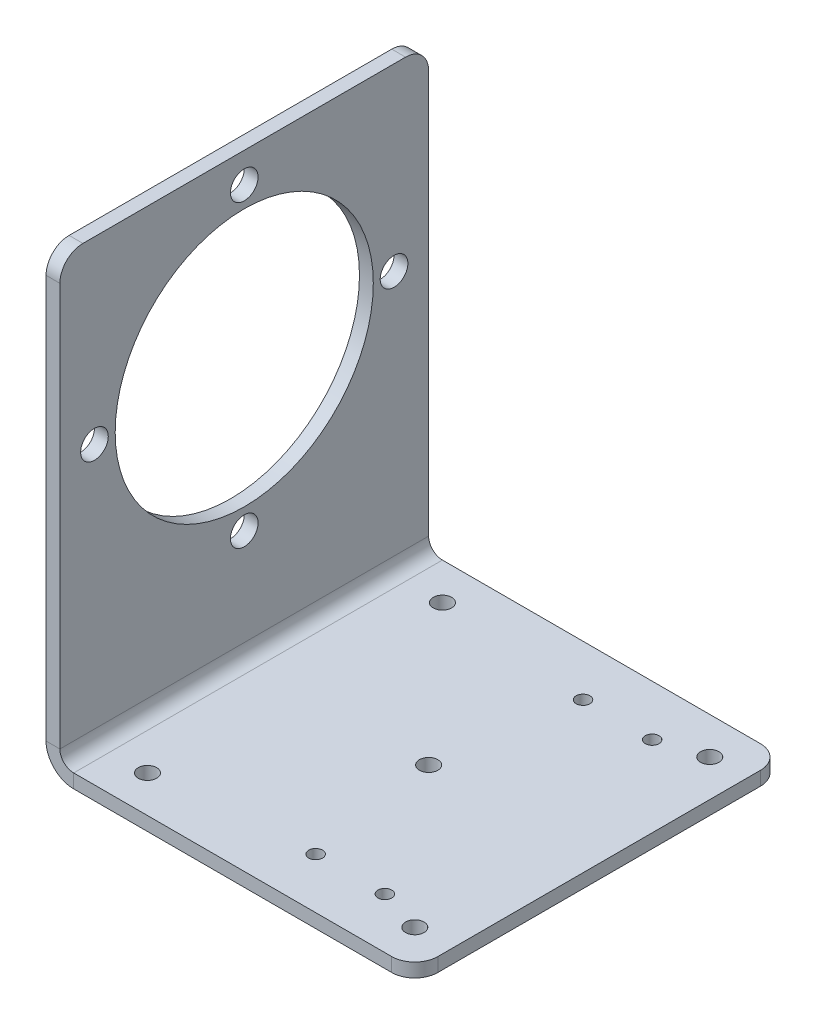
ISO-10303-21;
HEADER;
FILE_DESCRIPTION(('STEP AP214'),'2;1');
FILE_NAME('part.step','',(''),(''),'','','');
FILE_SCHEMA(('AUTOMOTIVE_DESIGN { 1 0 10303 214 1 1 1 1 }'));
ENDSEC;
DATA;
#1=APPLICATION_CONTEXT('core data for automotive mechanical design processes');
#2=APPLICATION_PROTOCOL_DEFINITION('international standard','automotive_design',2000,#1);
#3=PRODUCT_CONTEXT('',#1,'mechanical');
#4=PRODUCT('Part','Part','',(#3));
#5=PRODUCT_RELATED_PRODUCT_CATEGORY('part','',(#4));
#6=PRODUCT_DEFINITION_FORMATION('','',#4);
#7=PRODUCT_DEFINITION_CONTEXT('part definition',#1,'design');
#8=PRODUCT_DEFINITION('design','',#6,#7);
#9=PRODUCT_DEFINITION_SHAPE('','',#8);
#10=(LENGTH_UNIT() NAMED_UNIT(*) SI_UNIT(.MILLI.,.METRE.));
#11=(NAMED_UNIT(*) PLANE_ANGLE_UNIT() SI_UNIT($,.RADIAN.));
#12=(NAMED_UNIT(*) SI_UNIT($,.STERADIAN.) SOLID_ANGLE_UNIT());
#13=UNCERTAINTY_MEASURE_WITH_UNIT(LENGTH_MEASURE(1.E-05),#10,'distance_accuracy_value','');
#14=(GEOMETRIC_REPRESENTATION_CONTEXT(3) GLOBAL_UNCERTAINTY_ASSIGNED_CONTEXT((#13)) GLOBAL_UNIT_ASSIGNED_CONTEXT((#10,
#11,#12)) REPRESENTATION_CONTEXT('',''));
#15=CARTESIAN_POINT('',(0.,0.,0.));
#16=DIRECTION('',(0.,0.,1.));
#17=DIRECTION('',(1.,0.,0.));
#18=AXIS2_PLACEMENT_3D('',#15,#16,#17);
#19=CARTESIAN_POINT('',(0.,0.,0.));
#20=DIRECTION('',(-1.,0.,0.));
#21=DIRECTION('',(0.,0.,1.));
#22=AXIS2_PLACEMENT_3D('',#19,#20,#21);
#23=PLANE('',#22);
#24=CARTESIAN_POINT('',(0.,59.5000000000003,-72.5));
#25=DIRECTION('',(1.,0.,0.));
#26=DIRECTION('',(0.,0.,-1.));
#27=AXIS2_PLACEMENT_3D('',#24,#25,#26);
#28=CIRCLE('',#27,3.);
#29=CARTESIAN_POINT('',(0.,59.5000000000003,-75.5));
#30=VERTEX_POINT('',#29);
#31=EDGE_CURVE('E215',#30,#30,#28,.T.);
#32=ORIENTED_EDGE('',*,*,#31,.F.);
#33=EDGE_LOOP('',(#32));
#34=FACE_BOUND('',#33,.T.);
#35=CARTESIAN_POINT('',(0.,59.5,-40.));
#36=DIRECTION('',(1.,0.,0.));
#37=DIRECTION('',(0.,0.,-1.));
#38=AXIS2_PLACEMENT_3D('',#35,#36,#37);
#39=CIRCLE('',#38,28.);
#40=CARTESIAN_POINT('',(0.,59.5,-68.));
#41=VERTEX_POINT('',#40);
#42=EDGE_CURVE('E240',#41,#41,#39,.T.);
#43=ORIENTED_EDGE('',*,*,#42,.F.);
#44=EDGE_LOOP('',(#43));
#45=FACE_BOUND('',#44,.T.);
#46=CARTESIAN_POINT('',(0.,92.,-40.));
#47=DIRECTION('',(1.,0.,0.));
#48=DIRECTION('',(0.,0.,-1.));
#49=AXIS2_PLACEMENT_3D('',#46,#47,#48);
#50=CIRCLE('',#49,3.);
#51=CARTESIAN_POINT('',(0.,92.,-43.));
#52=VERTEX_POINT('',#51);
#53=EDGE_CURVE('E234',#52,#52,#50,.T.);
#54=ORIENTED_EDGE('',*,*,#53,.F.);
#55=EDGE_LOOP('',(#54));
#56=FACE_BOUND('',#55,.T.);
#57=CARTESIAN_POINT('',(0.,59.4999999999999,-7.50000000000001));
#58=DIRECTION('',(1.,0.,0.));
#59=DIRECTION('',(0.,0.,-1.));
#60=AXIS2_PLACEMENT_3D('',#57,#58,#59);
#61=CIRCLE('',#60,3.);
#62=CARTESIAN_POINT('',(0.,59.4999999999999,-10.5));
#63=VERTEX_POINT('',#62);
#64=EDGE_CURVE('E228',#63,#63,#61,.T.);
#65=ORIENTED_EDGE('',*,*,#64,.F.);
#66=EDGE_LOOP('',(#65));
#67=FACE_BOUND('',#66,.T.);
#68=CARTESIAN_POINT('',(0.,27.,-40.));
#69=DIRECTION('',(1.,0.,0.));
#70=DIRECTION('',(0.,0.,-1.));
#71=AXIS2_PLACEMENT_3D('',#68,#69,#70);
#72=CIRCLE('',#71,3.);
#73=CARTESIAN_POINT('',(0.,27.,-43.));
#74=VERTEX_POINT('',#73);
#75=EDGE_CURVE('E222',#74,#74,#72,.T.);
#76=ORIENTED_EDGE('',*,*,#75,.F.);
#77=EDGE_LOOP('',(#76));
#78=FACE_BOUND('',#77,.T.);
#79=DIRECTION('',(0.,1.,0.));
#80=VECTOR('',#79,1.);
#81=CARTESIAN_POINT('',(0.,0.,-80.));
#82=LINE('',#81,#80);
#83=CARTESIAN_POINT('',(0.,5.99999999999999,-80.));
#84=VERTEX_POINT('',#83);
#85=CARTESIAN_POINT('',(0.,93.5,-80.));
#86=VERTEX_POINT('',#85);
#87=EDGE_CURVE('E257',#84,#86,#82,.T.);
#88=ORIENTED_EDGE('',*,*,#87,.T.);
#89=CARTESIAN_POINT('',(0.,93.5,-75.));
#90=DIRECTION('',(-1.,0.,0.));
#91=DIRECTION('',(0.,0.,1.));
#92=AXIS2_PLACEMENT_3D('',#89,#90,#91);
#93=CIRCLE('',#92,5.);
#94=CARTESIAN_POINT('',(0.,98.5,-75.));
#95=VERTEX_POINT('',#94);
#96=EDGE_CURVE('E283',#86,#95,#93,.F.);
#97=ORIENTED_EDGE('',*,*,#96,.T.);
#98=DIRECTION('',(0.,0.,1.));
#99=VECTOR('',#98,1.);
#100=CARTESIAN_POINT('',(0.,98.5,0.));
#101=LINE('',#100,#99);
#102=CARTESIAN_POINT('',(0.,98.5,-5.));
#103=VERTEX_POINT('',#102);
#104=EDGE_CURVE('E250',#95,#103,#101,.T.);
#105=ORIENTED_EDGE('',*,*,#104,.T.);
#106=CARTESIAN_POINT('',(0.,93.5,-5.));
#107=DIRECTION('',(-1.,0.,0.));
#108=DIRECTION('',(0.,0.,1.));
#109=AXIS2_PLACEMENT_3D('',#106,#107,#108);
#110=CIRCLE('',#109,5.);
#111=CARTESIAN_POINT('',(0.,93.5,0.));
#112=VERTEX_POINT('',#111);
#113=EDGE_CURVE('E281',#103,#112,#110,.F.);
#114=ORIENTED_EDGE('',*,*,#113,.T.);
#115=DIRECTION('',(0.,-1.,0.));
#116=VECTOR('',#115,1.);
#117=CARTESIAN_POINT('',(0.,0.,0.));
#118=LINE('',#117,#116);
#119=CARTESIAN_POINT('',(0.,5.99999999999999,0.));
#120=VERTEX_POINT('',#119);
#121=EDGE_CURVE('E244',#112,#120,#118,.T.);
#122=ORIENTED_EDGE('',*,*,#121,.T.);
#123=DIRECTION('',(0.,0.,-1.));
#124=VECTOR('',#123,1.);
#125=CARTESIAN_POINT('',(0.,5.99999999999999,-80.));
#126=LINE('',#125,#124);
#127=EDGE_CURVE('E208',#84,#120,#126,.F.);
#128=ORIENTED_EDGE('',*,*,#127,.F.);
#129=EDGE_LOOP('',(#88,#97,#105,#114,#122,#128));
#130=FACE_BOUND('',#129,.T.);
#131=ADVANCED_FACE('F59',(#34,#45,#56,#67,#78,#130),#23,.F.);
#132=CARTESIAN_POINT('',(-3.,0.,0.));
#133=DIRECTION('',(-1.,0.,0.));
#134=DIRECTION('',(0.,0.,1.));
#135=AXIS2_PLACEMENT_3D('',#132,#133,#134);
#136=PLANE('',#135);
#137=CARTESIAN_POINT('',(-3.,59.5000000000003,-72.5));
#138=DIRECTION('',(1.,0.,0.));
#139=DIRECTION('',(0.,0.,-1.));
#140=AXIS2_PLACEMENT_3D('',#137,#138,#139);
#141=CIRCLE('',#140,3.);
#142=CARTESIAN_POINT('',(-3.,59.5000000000003,-75.5));
#143=VERTEX_POINT('',#142);
#144=EDGE_CURVE('E219',#143,#143,#141,.T.);
#145=ORIENTED_EDGE('',*,*,#144,.T.);
#146=EDGE_LOOP('',(#145));
#147=FACE_BOUND('',#146,.T.);
#148=CARTESIAN_POINT('',(-3.,59.5,-40.));
#149=DIRECTION('',(1.,0.,0.));
#150=DIRECTION('',(0.,0.,-1.));
#151=AXIS2_PLACEMENT_3D('',#148,#149,#150);
#152=CIRCLE('',#151,28.);
#153=CARTESIAN_POINT('',(-3.,59.5,-68.));
#154=VERTEX_POINT('',#153);
#155=EDGE_CURVE('E241',#154,#154,#152,.T.);
#156=ORIENTED_EDGE('',*,*,#155,.T.);
#157=EDGE_LOOP('',(#156));
#158=FACE_BOUND('',#157,.T.);
#159=CARTESIAN_POINT('',(-3.,92.,-40.));
#160=DIRECTION('',(1.,0.,0.));
#161=DIRECTION('',(0.,0.,-1.));
#162=AXIS2_PLACEMENT_3D('',#159,#160,#161);
#163=CIRCLE('',#162,3.);
#164=CARTESIAN_POINT('',(-3.,92.,-43.));
#165=VERTEX_POINT('',#164);
#166=EDGE_CURVE('E237',#165,#165,#163,.T.);
#167=ORIENTED_EDGE('',*,*,#166,.T.);
#168=EDGE_LOOP('',(#167));
#169=FACE_BOUND('',#168,.T.);
#170=CARTESIAN_POINT('',(-3.,59.4999999999999,-7.50000000000001));
#171=DIRECTION('',(1.,0.,0.));
#172=DIRECTION('',(0.,0.,-1.));
#173=AXIS2_PLACEMENT_3D('',#170,#171,#172);
#174=CIRCLE('',#173,3.);
#175=CARTESIAN_POINT('',(-3.,59.4999999999999,-10.5));
#176=VERTEX_POINT('',#175);
#177=EDGE_CURVE('E231',#176,#176,#174,.T.);
#178=ORIENTED_EDGE('',*,*,#177,.T.);
#179=EDGE_LOOP('',(#178));
#180=FACE_BOUND('',#179,.T.);
#181=CARTESIAN_POINT('',(-3.,27.,-40.));
#182=DIRECTION('',(1.,0.,0.));
#183=DIRECTION('',(0.,0.,-1.));
#184=AXIS2_PLACEMENT_3D('',#181,#182,#183);
#185=CIRCLE('',#184,3.);
#186=CARTESIAN_POINT('',(-3.,27.,-43.));
#187=VERTEX_POINT('',#186);
#188=EDGE_CURVE('E225',#187,#187,#185,.T.);
#189=ORIENTED_EDGE('',*,*,#188,.T.);
#190=EDGE_LOOP('',(#189));
#191=FACE_BOUND('',#190,.T.);
#192=DIRECTION('',(0.,0.,1.));
#193=VECTOR('',#192,1.);
#194=CARTESIAN_POINT('',(-3.,98.5,0.));
#195=LINE('',#194,#193);
#196=CARTESIAN_POINT('',(-3.,98.5,-75.));
#197=VERTEX_POINT('',#196);
#198=CARTESIAN_POINT('',(-3.,98.5,-5.));
#199=VERTEX_POINT('',#198);
#200=EDGE_CURVE('E253',#197,#199,#195,.T.);
#201=ORIENTED_EDGE('',*,*,#200,.F.);
#202=CARTESIAN_POINT('',(-3.,93.5,-75.));
#203=DIRECTION('',(-1.,0.,0.));
#204=DIRECTION('',(0.,0.,1.));
#205=AXIS2_PLACEMENT_3D('',#202,#203,#204);
#206=CIRCLE('',#205,5.);
#207=CARTESIAN_POINT('',(-3.,93.5,-80.));
#208=VERTEX_POINT('',#207);
#209=EDGE_CURVE('E67',#197,#208,#206,.T.);
#210=ORIENTED_EDGE('',*,*,#209,.T.);
#211=DIRECTION('',(0.,1.,0.));
#212=VECTOR('',#211,1.);
#213=CARTESIAN_POINT('',(-3.,0.,-80.));
#214=LINE('',#213,#212);
#215=CARTESIAN_POINT('',(-3.,5.99999999999999,-80.));
#216=VERTEX_POINT('',#215);
#217=EDGE_CURVE('E249',#216,#208,#214,.T.);
#218=ORIENTED_EDGE('',*,*,#217,.F.);
#219=DIRECTION('',(0.,0.,-1.));
#220=VECTOR('',#219,1.);
#221=CARTESIAN_POINT('',(-3.,5.99999999999999,-80.));
#222=LINE('',#221,#220);
#223=CARTESIAN_POINT('',(-3.,5.99999999999999,0.));
#224=VERTEX_POINT('',#223);
#225=EDGE_CURVE('E156',#216,#224,#222,.F.);
#226=ORIENTED_EDGE('',*,*,#225,.T.);
#227=DIRECTION('',(0.,-1.,0.));
#228=VECTOR('',#227,1.);
#229=CARTESIAN_POINT('',(-3.,0.,0.));
#230=LINE('',#229,#228);
#231=CARTESIAN_POINT('',(-3.,93.5,0.));
#232=VERTEX_POINT('',#231);
#233=EDGE_CURVE('E247',#232,#224,#230,.T.);
#234=ORIENTED_EDGE('',*,*,#233,.F.);
#235=CARTESIAN_POINT('',(-3.,93.5,-5.));
#236=DIRECTION('',(-1.,0.,0.));
#237=DIRECTION('',(0.,0.,1.));
#238=AXIS2_PLACEMENT_3D('',#235,#236,#237);
#239=CIRCLE('',#238,5.);
#240=EDGE_CURVE('E79',#232,#199,#239,.T.);
#241=ORIENTED_EDGE('',*,*,#240,.T.);
#242=EDGE_LOOP('',(#201,#210,#218,#226,#234,#241));
#243=FACE_BOUND('',#242,.T.);
#244=ADVANCED_FACE('F292',(#147,#158,#169,#180,#191,#243),#136,.T.);
#245=CARTESIAN_POINT('',(-3.,0.,-80.));
#246=DIRECTION('',(0.,0.,-1.));
#247=DIRECTION('',(-1.,0.,0.));
#248=AXIS2_PLACEMENT_3D('',#245,#246,#247);
#249=PLANE('',#248);
#250=ORIENTED_EDGE('',*,*,#217,.T.);
#251=DIRECTION('',(1.,0.,0.));
#252=VECTOR('',#251,1.);
#253=CARTESIAN_POINT('',(-3.,93.5,-80.));
#254=LINE('',#253,#252);
#255=EDGE_CURVE('E278',#208,#86,#254,.T.);
#256=ORIENTED_EDGE('',*,*,#255,.T.);
#257=ORIENTED_EDGE('',*,*,#87,.F.);
#258=DIRECTION('',(-1.,0.,0.));
#259=VECTOR('',#258,1.);
#260=CARTESIAN_POINT('',(0.,5.99999999999999,-80.));
#261=LINE('',#260,#259);
#262=EDGE_CURVE('E204',#84,#216,#261,.T.);
#263=ORIENTED_EDGE('',*,*,#262,.T.);
#264=EDGE_LOOP('',(#250,#256,#257,#263));
#265=FACE_BOUND('',#264,.T.);
#266=ADVANCED_FACE('F297',(#265),#249,.T.);
#267=CARTESIAN_POINT('',(-3.,0.,0.));
#268=DIRECTION('',(0.,0.,1.));
#269=DIRECTION('',(1.,0.,0.));
#270=AXIS2_PLACEMENT_3D('',#267,#268,#269);
#271=PLANE('',#270);
#272=ORIENTED_EDGE('',*,*,#121,.F.);
#273=DIRECTION('',(1.,0.,0.));
#274=VECTOR('',#273,1.);
#275=CARTESIAN_POINT('',(-3.,93.5,0.));
#276=LINE('',#275,#274);
#277=EDGE_CURVE('E13',#112,#232,#276,.F.);
#278=ORIENTED_EDGE('',*,*,#277,.T.);
#279=ORIENTED_EDGE('',*,*,#233,.T.);
#280=DIRECTION('',(-1.,0.,0.));
#281=VECTOR('',#280,1.);
#282=CARTESIAN_POINT('',(0.,5.99999999999999,0.));
#283=LINE('',#282,#281);
#284=EDGE_CURVE('E212',#120,#224,#283,.T.);
#285=ORIENTED_EDGE('',*,*,#284,.F.);
#286=EDGE_LOOP('',(#272,#278,#279,#285));
#287=FACE_BOUND('',#286,.T.);
#288=ADVANCED_FACE('F308',(#287),#271,.T.);
#289=CARTESIAN_POINT('',(-3.,98.5,0.));
#290=DIRECTION('',(0.,1.,0.));
#291=DIRECTION('',(0.,0.,1.));
#292=AXIS2_PLACEMENT_3D('',#289,#290,#291);
#293=PLANE('',#292);
#294=ORIENTED_EDGE('',*,*,#104,.F.);
#295=DIRECTION('',(1.,0.,0.));
#296=VECTOR('',#295,1.);
#297=CARTESIAN_POINT('',(-3.,98.5,-75.));
#298=LINE('',#297,#296);
#299=EDGE_CURVE('E288',#95,#197,#298,.F.);
#300=ORIENTED_EDGE('',*,*,#299,.T.);
#301=ORIENTED_EDGE('',*,*,#200,.T.);
#302=DIRECTION('',(1.,0.,0.));
#303=VECTOR('',#302,1.);
#304=CARTESIAN_POINT('',(-3.,98.5,-5.));
#305=LINE('',#304,#303);
#306=EDGE_CURVE('E285',#199,#103,#305,.T.);
#307=ORIENTED_EDGE('',*,*,#306,.T.);
#308=EDGE_LOOP('',(#294,#300,#301,#307));
#309=FACE_BOUND('',#308,.T.);
#310=ADVANCED_FACE('F304',(#309),#293,.T.);
#311=CARTESIAN_POINT('',(-3.,59.5,-40.));
#312=DIRECTION('',(1.,0.,0.));
#313=DIRECTION('',(0.,0.,-1.));
#314=AXIS2_PLACEMENT_3D('',#311,#312,#313);
#315=CYLINDRICAL_SURFACE('',#314,28.);
#316=ORIENTED_EDGE('',*,*,#155,.F.);
#317=EDGE_LOOP('',(#316));
#318=FACE_BOUND('',#317,.T.);
#319=ORIENTED_EDGE('',*,*,#42,.T.);
#320=EDGE_LOOP('',(#319));
#321=FACE_BOUND('',#320,.T.);
#322=ADVANCED_FACE('F437',(#318,#321),#315,.F.);
#323=CARTESIAN_POINT('',(0.,92.,-40.));
#324=DIRECTION('',(1.,0.,0.));
#325=DIRECTION('',(0.,0.,-1.));
#326=AXIS2_PLACEMENT_3D('',#323,#324,#325);
#327=CYLINDRICAL_SURFACE('',#326,3.);
#328=ORIENTED_EDGE('',*,*,#166,.F.);
#329=EDGE_LOOP('',(#328));
#330=FACE_BOUND('',#329,.T.);
#331=ORIENTED_EDGE('',*,*,#53,.T.);
#332=EDGE_LOOP('',(#331));
#333=FACE_BOUND('',#332,.T.);
#334=ADVANCED_FACE('F673',(#330,#333),#327,.F.);
#335=CARTESIAN_POINT('',(0.,59.4999999999999,-7.50000000000001));
#336=DIRECTION('',(1.,0.,0.));
#337=DIRECTION('',(0.,0.,-1.));
#338=AXIS2_PLACEMENT_3D('',#335,#336,#337);
#339=CYLINDRICAL_SURFACE('',#338,3.);
#340=ORIENTED_EDGE('',*,*,#177,.F.);
#341=EDGE_LOOP('',(#340));
#342=FACE_BOUND('',#341,.T.);
#343=ORIENTED_EDGE('',*,*,#64,.T.);
#344=EDGE_LOOP('',(#343));
#345=FACE_BOUND('',#344,.T.);
#346=ADVANCED_FACE('F716',(#342,#345),#339,.F.);
#347=CARTESIAN_POINT('',(0.,27.,-40.));
#348=DIRECTION('',(1.,0.,0.));
#349=DIRECTION('',(0.,0.,-1.));
#350=AXIS2_PLACEMENT_3D('',#347,#348,#349);
#351=CYLINDRICAL_SURFACE('',#350,3.);
#352=ORIENTED_EDGE('',*,*,#188,.F.);
#353=EDGE_LOOP('',(#352));
#354=FACE_BOUND('',#353,.T.);
#355=ORIENTED_EDGE('',*,*,#75,.T.);
#356=EDGE_LOOP('',(#355));
#357=FACE_BOUND('',#356,.T.);
#358=ADVANCED_FACE('F709',(#354,#357),#351,.F.);
#359=CARTESIAN_POINT('',(0.,59.5000000000003,-72.5));
#360=DIRECTION('',(1.,0.,0.));
#361=DIRECTION('',(0.,0.,-1.));
#362=AXIS2_PLACEMENT_3D('',#359,#360,#361);
#363=CYLINDRICAL_SURFACE('',#362,3.);
#364=ORIENTED_EDGE('',*,*,#144,.F.);
#365=EDGE_LOOP('',(#364));
#366=FACE_BOUND('',#365,.T.);
#367=ORIENTED_EDGE('',*,*,#31,.T.);
#368=EDGE_LOOP('',(#367));
#369=FACE_BOUND('',#368,.T.);
#370=ADVANCED_FACE('F644',(#366,#369),#363,.F.);
#371=CARTESIAN_POINT('',(3.,5.99999999999999,0.));
#372=DIRECTION('',(0.,0.,1.));
#373=DIRECTION('',(1.,0.,0.));
#374=AXIS2_PLACEMENT_3D('',#371,#372,#373);
#375=PLANE('',#374);
#376=DIRECTION('',(0.,1.,0.));
#377=VECTOR('',#376,1.);
#378=CARTESIAN_POINT('',(2.99999999999998,0.,0.));
#379=LINE('',#378,#377);
#380=CARTESIAN_POINT('',(2.99999999999999,2.99999999999999,0.));
#381=VERTEX_POINT('',#380);
#382=CARTESIAN_POINT('',(2.99999999999998,0.,0.));
#383=VERTEX_POINT('',#382);
#384=EDGE_CURVE('E198',#381,#383,#379,.F.);
#385=ORIENTED_EDGE('',*,*,#384,.F.);
#386=CARTESIAN_POINT('',(3.,5.99999999999999,0.));
#387=DIRECTION('',(0.,0.,-1.));
#388=DIRECTION('',(-1.,0.,0.));
#389=AXIS2_PLACEMENT_3D('',#386,#387,#388);
#390=CIRCLE('',#389,3.);
#391=EDGE_CURVE('E159',#120,#381,#390,.F.);
#392=ORIENTED_EDGE('',*,*,#391,.F.);
#393=ORIENTED_EDGE('',*,*,#284,.T.);
#394=CARTESIAN_POINT('',(3.,5.99999999999999,0.));
#395=DIRECTION('',(0.,0.,-1.));
#396=DIRECTION('',(-1.,0.,0.));
#397=AXIS2_PLACEMENT_3D('',#394,#395,#396);
#398=CIRCLE('',#397,6.);
#399=EDGE_CURVE('E203',#224,#383,#398,.F.);
#400=ORIENTED_EDGE('',*,*,#399,.T.);
#401=EDGE_LOOP('',(#385,#392,#393,#400));
#402=FACE_BOUND('',#401,.T.);
#403=ADVANCED_FACE('F312',(#402),#375,.T.);
#404=CARTESIAN_POINT('',(3.,5.99999999999999,-80.));
#405=DIRECTION('',(0.,0.,1.));
#406=DIRECTION('',(1.,0.,0.));
#407=AXIS2_PLACEMENT_3D('',#404,#405,#406);
#408=PLANE('',#407);
#409=CARTESIAN_POINT('',(3.,5.99999999999999,-80.));
#410=DIRECTION('',(0.,0.,-1.));
#411=DIRECTION('',(-1.,0.,0.));
#412=AXIS2_PLACEMENT_3D('',#409,#410,#411);
#413=CIRCLE('',#412,3.);
#414=CARTESIAN_POINT('',(2.99999999999999,2.99999999999999,-80.));
#415=VERTEX_POINT('',#414);
#416=EDGE_CURVE('E166',#415,#84,#413,.T.);
#417=ORIENTED_EDGE('',*,*,#416,.F.);
#418=DIRECTION('',(0.,1.,0.));
#419=VECTOR('',#418,1.);
#420=CARTESIAN_POINT('',(2.99999999999999,2.99999999999999,-80.));
#421=LINE('',#420,#419);
#422=CARTESIAN_POINT('',(2.99999999999998,0.,-80.));
#423=VERTEX_POINT('',#422);
#424=EDGE_CURVE('E163',#415,#423,#421,.F.);
#425=ORIENTED_EDGE('',*,*,#424,.T.);
#426=CARTESIAN_POINT('',(3.,5.99999999999999,-80.));
#427=DIRECTION('',(0.,0.,-1.));
#428=DIRECTION('',(-1.,0.,0.));
#429=AXIS2_PLACEMENT_3D('',#426,#427,#428);
#430=CIRCLE('',#429,6.);
#431=EDGE_CURVE('E148',#423,#216,#430,.T.);
#432=ORIENTED_EDGE('',*,*,#431,.T.);
#433=ORIENTED_EDGE('',*,*,#262,.F.);
#434=EDGE_LOOP('',(#417,#425,#432,#433));
#435=FACE_BOUND('',#434,.T.);
#436=ADVANCED_FACE('F164',(#435),#408,.F.);
#437=CARTESIAN_POINT('',(3.,5.99999999999999,-80.));
#438=DIRECTION('',(0.,0.,-1.));
#439=DIRECTION('',(0.,-1.,0.));
#440=AXIS2_PLACEMENT_3D('',#437,#438,#439);
#441=CYLINDRICAL_SURFACE('',#440,6.);
#442=ORIENTED_EDGE('',*,*,#225,.F.);
#443=ORIENTED_EDGE('',*,*,#431,.F.);
#444=DIRECTION('',(0.,0.,-1.));
#445=VECTOR('',#444,1.);
#446=CARTESIAN_POINT('',(2.99999999999998,0.,0.));
#447=LINE('',#446,#445);
#448=EDGE_CURVE('E153',#423,#383,#447,.F.);
#449=ORIENTED_EDGE('',*,*,#448,.T.);
#450=ORIENTED_EDGE('',*,*,#399,.F.);
#451=EDGE_LOOP('',(#442,#443,#449,#450));
#452=FACE_BOUND('',#451,.T.);
#453=ADVANCED_FACE('F150',(#452),#441,.T.);
#454=CARTESIAN_POINT('',(3.,5.99999999999999,-80.));
#455=DIRECTION('',(0.,0.,-1.));
#456=DIRECTION('',(0.,-1.,0.));
#457=AXIS2_PLACEMENT_3D('',#454,#455,#456);
#458=CYLINDRICAL_SURFACE('',#457,3.);
#459=ORIENTED_EDGE('',*,*,#127,.T.);
#460=ORIENTED_EDGE('',*,*,#391,.T.);
#461=DIRECTION('',(0.,0.,-1.));
#462=VECTOR('',#461,1.);
#463=CARTESIAN_POINT('',(2.99999999999999,2.99999999999999,0.));
#464=LINE('',#463,#462);
#465=EDGE_CURVE('E171',#381,#415,#464,.T.);
#466=ORIENTED_EDGE('',*,*,#465,.T.);
#467=ORIENTED_EDGE('',*,*,#416,.T.);
#468=EDGE_LOOP('',(#459,#460,#466,#467));
#469=FACE_BOUND('',#468,.T.);
#470=ADVANCED_FACE('F315',(#469),#458,.F.);
#471=CARTESIAN_POINT('',(77.,-2.68882138776405E-13,-80.));
#472=DIRECTION('',(0.,0.,1.));
#473=DIRECTION('',(1.,0.,0.));
#474=AXIS2_PLACEMENT_3D('',#471,#472,#473);
#475=PLANE('',#474);
#476=DIRECTION('',(-1.,0.,0.));
#477=VECTOR('',#476,1.);
#478=CARTESIAN_POINT('',(77.,2.99999999999973,-80.));
#479=LINE('',#478,#477);
#480=CARTESIAN_POINT('',(72.,2.99999999999975,-80.));
#481=VERTEX_POINT('',#480);
#482=EDGE_CURVE('E181',#415,#481,#479,.F.);
#483=ORIENTED_EDGE('',*,*,#482,.T.);
#484=DIRECTION('',(0.,1.,0.));
#485=VECTOR('',#484,1.);
#486=CARTESIAN_POINT('',(72.,-2.51424732082189E-13,-80.));
#487=LINE('',#486,#485);
#488=CARTESIAN_POINT('',(72.,-2.51386656396706E-13,-80.));
#489=VERTEX_POINT('',#488);
#490=EDGE_CURVE('E185',#481,#489,#487,.F.);
#491=ORIENTED_EDGE('',*,*,#490,.T.);
#492=DIRECTION('',(1.,0.,0.));
#493=VECTOR('',#492,1.);
#494=CARTESIAN_POINT('',(0.,0.,-80.));
#495=LINE('',#494,#493);
#496=EDGE_CURVE('E177',#423,#489,#495,.T.);
#497=ORIENTED_EDGE('',*,*,#496,.F.);
#498=ORIENTED_EDGE('',*,*,#424,.F.);
#499=EDGE_LOOP('',(#483,#491,#497,#498));
#500=FACE_BOUND('',#499,.T.);
#501=ADVANCED_FACE('F183',(#500),#475,.F.);
#502=CARTESIAN_POINT('',(0.,0.,0.));
#503=DIRECTION('',(0.,0.,-1.));
#504=DIRECTION('',(-1.,0.,0.));
#505=AXIS2_PLACEMENT_3D('',#502,#503,#504);
#506=PLANE('',#505);
#507=DIRECTION('',(-1.,0.,0.));
#508=VECTOR('',#507,1.);
#509=CARTESIAN_POINT('',(0.,0.,0.));
#510=LINE('',#509,#508);
#511=CARTESIAN_POINT('',(72.,-2.51386656396706E-13,0.));
#512=VERTEX_POINT('',#511);
#513=EDGE_CURVE('E180',#512,#383,#510,.T.);
#514=ORIENTED_EDGE('',*,*,#513,.F.);
#515=DIRECTION('',(0.,1.,0.));
#516=VECTOR('',#515,1.);
#517=CARTESIAN_POINT('',(72.,-2.51386656396706E-13,0.));
#518=LINE('',#517,#516);
#519=CARTESIAN_POINT('',(72.,2.99999999999975,0.));
#520=VERTEX_POINT('',#519);
#521=EDGE_CURVE('E255',#512,#520,#518,.T.);
#522=ORIENTED_EDGE('',*,*,#521,.T.);
#523=DIRECTION('',(1.,0.,0.));
#524=VECTOR('',#523,1.);
#525=CARTESIAN_POINT('',(0.,3.,0.));
#526=LINE('',#525,#524);
#527=EDGE_CURVE('E187',#520,#381,#526,.F.);
#528=ORIENTED_EDGE('',*,*,#527,.T.);
#529=ORIENTED_EDGE('',*,*,#384,.T.);
#530=EDGE_LOOP('',(#514,#522,#528,#529));
#531=FACE_BOUND('',#530,.T.);
#532=ADVANCED_FACE('F332',(#531),#506,.F.);
#533=CARTESIAN_POINT('',(0.,0.,0.));
#534=DIRECTION('',(0.,1.,0.));
#535=DIRECTION('',(-1.,0.,0.));
#536=AXIS2_PLACEMENT_3D('',#533,#534,#535);
#537=PLANE('',#536);
#538=CARTESIAN_POINT('',(44.5,-6.86516815617821E-13,-69.));
#539=DIRECTION('',(0.,1.,0.));
#540=DIRECTION('',(0.,0.,1.));
#541=AXIS2_PLACEMENT_3D('',#538,#539,#540);
#542=CIRCLE('',#541,1.5);
#543=CARTESIAN_POINT('',(44.5,-6.86516815617821E-13,-67.5));
#544=VERTEX_POINT('',#543);
#545=EDGE_CURVE('E381',#544,#544,#542,.T.);
#546=ORIENTED_EDGE('',*,*,#545,.T.);
#547=EDGE_LOOP('',(#546));
#548=FACE_BOUND('',#547,.T.);
#549=CARTESIAN_POINT('',(59.5,-7.3899220076612E-13,-69.));
#550=DIRECTION('',(0.,1.,0.));
#551=DIRECTION('',(0.,0.,1.));
#552=AXIS2_PLACEMENT_3D('',#549,#550,#551);
#553=CIRCLE('',#552,1.5);
#554=CARTESIAN_POINT('',(59.5,-7.3899220076612E-13,-67.5));
#555=VERTEX_POINT('',#554);
#556=EDGE_CURVE('E375',#555,#555,#553,.T.);
#557=ORIENTED_EDGE('',*,*,#556,.T.);
#558=EDGE_LOOP('',(#557));
#559=FACE_BOUND('',#558,.T.);
#560=CARTESIAN_POINT('',(44.5,-6.86516815617821E-13,-11.));
#561=DIRECTION('',(0.,1.,0.));
#562=DIRECTION('',(0.,0.,1.));
#563=AXIS2_PLACEMENT_3D('',#560,#561,#562);
#564=CIRCLE('',#563,1.5);
#565=CARTESIAN_POINT('',(44.5,-6.86516815617821E-13,-9.5));
#566=VERTEX_POINT('',#565);
#567=EDGE_CURVE('E369',#566,#566,#564,.T.);
#568=ORIENTED_EDGE('',*,*,#567,.T.);
#569=EDGE_LOOP('',(#568));
#570=FACE_BOUND('',#569,.T.);
#571=CARTESIAN_POINT('',(59.5,-7.3899220076612E-13,-11.));
#572=DIRECTION('',(0.,1.,0.));
#573=DIRECTION('',(0.,0.,1.));
#574=AXIS2_PLACEMENT_3D('',#571,#572,#573);
#575=CIRCLE('',#574,1.5);
#576=CARTESIAN_POINT('',(59.5,-7.3899220076612E-13,-9.49999999999999));
#577=VERTEX_POINT('',#576);
#578=EDGE_CURVE('E363',#577,#577,#575,.T.);
#579=ORIENTED_EDGE('',*,*,#578,.T.);
#580=EDGE_LOOP('',(#579));
#581=FACE_BOUND('',#580,.T.);
#582=CARTESIAN_POINT('',(11.,-3.18755438710738E-13,-7.99999999999999));
#583=DIRECTION('',(0.,1.,0.));
#584=DIRECTION('',(0.,0.,1.));
#585=AXIS2_PLACEMENT_3D('',#582,#583,#584);
#586=CIRCLE('',#585,1.99999999999999);
#587=CARTESIAN_POINT('',(11.,-3.18755438710738E-13,-6.00000000000001));
#588=VERTEX_POINT('',#587);
#589=EDGE_CURVE('E357',#588,#588,#586,.T.);
#590=ORIENTED_EDGE('',*,*,#589,.T.);
#591=EDGE_LOOP('',(#590));
#592=FACE_BOUND('',#591,.T.);
#593=CARTESIAN_POINT('',(11.,-3.18755438710738E-13,-72.));
#594=DIRECTION('',(0.,1.,0.));
#595=DIRECTION('',(0.,0.,1.));
#596=AXIS2_PLACEMENT_3D('',#593,#594,#595);
#597=CIRCLE('',#596,1.99999999999999);
#598=CARTESIAN_POINT('',(11.,-3.18755438710738E-13,-70.));
#599=VERTEX_POINT('',#598);
#600=EDGE_CURVE('E351',#599,#599,#597,.T.);
#601=ORIENTED_EDGE('',*,*,#600,.T.);
#602=EDGE_LOOP('',(#601));
#603=FACE_BOUND('',#602,.T.);
#604=CARTESIAN_POINT('',(69.,-5.21284404531031E-13,-72.));
#605=DIRECTION('',(0.,1.,0.));
#606=DIRECTION('',(0.,0.,1.));
#607=AXIS2_PLACEMENT_3D('',#604,#605,#606);
#608=CIRCLE('',#607,1.99999999999999);
#609=CARTESIAN_POINT('',(69.,-5.21284404531031E-13,-70.));
#610=VERTEX_POINT('',#609);
#611=EDGE_CURVE('E345',#610,#610,#608,.T.);
#612=ORIENTED_EDGE('',*,*,#611,.T.);
#613=EDGE_LOOP('',(#612));
#614=FACE_BOUND('',#613,.T.);
#615=CARTESIAN_POINT('',(69.,-5.21284404531031E-13,-8.));
#616=DIRECTION('',(0.,1.,0.));
#617=DIRECTION('',(0.,0.,1.));
#618=AXIS2_PLACEMENT_3D('',#615,#616,#617);
#619=CIRCLE('',#618,1.99999999999999);
#620=CARTESIAN_POINT('',(69.,-5.21284404531031E-13,-6.00000000000001));
#621=VERTEX_POINT('',#620);
#622=EDGE_CURVE('E339',#621,#621,#619,.T.);
#623=ORIENTED_EDGE('',*,*,#622,.T.);
#624=EDGE_LOOP('',(#623));
#625=FACE_BOUND('',#624,.T.);
#626=CARTESIAN_POINT('',(40.,-4.19803081186387E-13,-40.));
#627=DIRECTION('',(0.,1.,0.));
#628=DIRECTION('',(0.,0.,1.));
#629=AXIS2_PLACEMENT_3D('',#626,#627,#628);
#630=CIRCLE('',#629,1.99999999999999);
#631=CARTESIAN_POINT('',(40.,-4.19803081186387E-13,-38.));
#632=VERTEX_POINT('',#631);
#633=EDGE_CURVE('E201',#632,#632,#630,.T.);
#634=ORIENTED_EDGE('',*,*,#633,.T.);
#635=EDGE_LOOP('',(#634));
#636=FACE_BOUND('',#635,.T.);
#637=DIRECTION('',(0.,0.,1.));
#638=VECTOR('',#637,1.);
#639=CARTESIAN_POINT('',(77.,-2.68844063090921E-13,0.));
#640=LINE('',#639,#638);
#641=CARTESIAN_POINT('',(77.,-2.68844063090921E-13,-75.));
#642=VERTEX_POINT('',#641);
#643=CARTESIAN_POINT('',(77.,-2.68844063090921E-13,-5.));
#644=VERTEX_POINT('',#643);
#645=EDGE_CURVE('E186',#642,#644,#640,.T.);
#646=ORIENTED_EDGE('',*,*,#645,.T.);
#647=CARTESIAN_POINT('',(72.,-2.51386656396706E-13,-5.));
#648=DIRECTION('',(0.,1.,0.));
#649=DIRECTION('',(-1.,0.,0.));
#650=AXIS2_PLACEMENT_3D('',#647,#648,#649);
#651=CIRCLE('',#650,5.);
#652=EDGE_CURVE('E275',#644,#512,#651,.F.);
#653=ORIENTED_EDGE('',*,*,#652,.T.);
#654=ORIENTED_EDGE('',*,*,#513,.T.);
#655=ORIENTED_EDGE('',*,*,#448,.F.);
#656=ORIENTED_EDGE('',*,*,#496,.T.);
#657=CARTESIAN_POINT('',(72.,-2.51386656396706E-13,-75.));
#658=DIRECTION('',(0.,1.,0.));
#659=DIRECTION('',(-1.,0.,0.));
#660=AXIS2_PLACEMENT_3D('',#657,#658,#659);
#661=CIRCLE('',#660,5.);
#662=EDGE_CURVE('E273',#489,#642,#661,.F.);
#663=ORIENTED_EDGE('',*,*,#662,.T.);
#664=EDGE_LOOP('',(#646,#653,#654,#655,#656,#663));
#665=FACE_BOUND('',#664,.T.);
#666=ADVANCED_FACE('F176',(#548,#559,#570,#581,#592,#603,#614,#625,#636,#665),#537,.F.);
#667=CARTESIAN_POINT('',(0.,3.,0.));
#668=DIRECTION('',(0.,1.,0.));
#669=DIRECTION('',(-1.,0.,0.));
#670=AXIS2_PLACEMENT_3D('',#667,#668,#669);
#671=PLANE('',#670);
#672=CARTESIAN_POINT('',(44.5,2.99999999999985,-69.));
#673=DIRECTION('',(0.,1.,0.));
#674=DIRECTION('',(0.,0.,1.));
#675=AXIS2_PLACEMENT_3D('',#672,#673,#674);
#676=CIRCLE('',#675,1.5);
#677=CARTESIAN_POINT('',(44.5,2.99999999999985,-67.5));
#678=VERTEX_POINT('',#677);
#679=EDGE_CURVE('E384',#678,#678,#676,.T.);
#680=ORIENTED_EDGE('',*,*,#679,.F.);
#681=EDGE_LOOP('',(#680));
#682=FACE_BOUND('',#681,.T.);
#683=CARTESIAN_POINT('',(59.5,2.99999999999979,-69.));
#684=DIRECTION('',(0.,1.,0.));
#685=DIRECTION('',(0.,0.,1.));
#686=AXIS2_PLACEMENT_3D('',#683,#684,#685);
#687=CIRCLE('',#686,1.5);
#688=CARTESIAN_POINT('',(59.5,2.99999999999979,-67.5));
#689=VERTEX_POINT('',#688);
#690=EDGE_CURVE('E378',#689,#689,#687,.T.);
#691=ORIENTED_EDGE('',*,*,#690,.F.);
#692=EDGE_LOOP('',(#691));
#693=FACE_BOUND('',#692,.T.);
#694=CARTESIAN_POINT('',(44.5,2.99999999999985,-11.));
#695=DIRECTION('',(0.,1.,0.));
#696=DIRECTION('',(0.,0.,1.));
#697=AXIS2_PLACEMENT_3D('',#694,#695,#696);
#698=CIRCLE('',#697,1.5);
#699=CARTESIAN_POINT('',(44.5,2.99999999999985,-9.5));
#700=VERTEX_POINT('',#699);
#701=EDGE_CURVE('E372',#700,#700,#698,.T.);
#702=ORIENTED_EDGE('',*,*,#701,.F.);
#703=EDGE_LOOP('',(#702));
#704=FACE_BOUND('',#703,.T.);
#705=CARTESIAN_POINT('',(59.5,2.99999999999979,-11.));
#706=DIRECTION('',(0.,1.,0.));
#707=DIRECTION('',(0.,0.,1.));
#708=AXIS2_PLACEMENT_3D('',#705,#706,#707);
#709=CIRCLE('',#708,1.5);
#710=CARTESIAN_POINT('',(59.5,2.99999999999979,-9.49999999999999));
#711=VERTEX_POINT('',#710);
#712=EDGE_CURVE('E366',#711,#711,#709,.T.);
#713=ORIENTED_EDGE('',*,*,#712,.F.);
#714=EDGE_LOOP('',(#713));
#715=FACE_BOUND('',#714,.T.);
#716=CARTESIAN_POINT('',(11.,2.99999999999996,-7.99999999999999));
#717=DIRECTION('',(0.,1.,0.));
#718=DIRECTION('',(0.,0.,1.));
#719=AXIS2_PLACEMENT_3D('',#716,#717,#718);
#720=CIRCLE('',#719,1.99999999999999);
#721=CARTESIAN_POINT('',(11.,2.99999999999996,-6.00000000000001));
#722=VERTEX_POINT('',#721);
#723=EDGE_CURVE('E360',#722,#722,#720,.T.);
#724=ORIENTED_EDGE('',*,*,#723,.F.);
#725=EDGE_LOOP('',(#724));
#726=FACE_BOUND('',#725,.T.);
#727=CARTESIAN_POINT('',(11.,2.99999999999996,-72.));
#728=DIRECTION('',(0.,1.,0.));
#729=DIRECTION('',(0.,0.,1.));
#730=AXIS2_PLACEMENT_3D('',#727,#728,#729);
#731=CIRCLE('',#730,1.99999999999999);
#732=CARTESIAN_POINT('',(11.,2.99999999999996,-70.));
#733=VERTEX_POINT('',#732);
#734=EDGE_CURVE('E354',#733,#733,#731,.T.);
#735=ORIENTED_EDGE('',*,*,#734,.F.);
#736=EDGE_LOOP('',(#735));
#737=FACE_BOUND('',#736,.T.);
#738=CARTESIAN_POINT('',(69.,2.99999999999976,-72.));
#739=DIRECTION('',(0.,1.,0.));
#740=DIRECTION('',(0.,0.,1.));
#741=AXIS2_PLACEMENT_3D('',#738,#739,#740);
#742=CIRCLE('',#741,1.99999999999999);
#743=CARTESIAN_POINT('',(69.,2.99999999999976,-70.));
#744=VERTEX_POINT('',#743);
#745=EDGE_CURVE('E348',#744,#744,#742,.T.);
#746=ORIENTED_EDGE('',*,*,#745,.F.);
#747=EDGE_LOOP('',(#746));
#748=FACE_BOUND('',#747,.T.);
#749=CARTESIAN_POINT('',(69.,2.99999999999976,-8.));
#750=DIRECTION('',(0.,1.,0.));
#751=DIRECTION('',(0.,0.,1.));
#752=AXIS2_PLACEMENT_3D('',#749,#750,#751);
#753=CIRCLE('',#752,1.99999999999999);
#754=CARTESIAN_POINT('',(69.,2.99999999999976,-6.00000000000001));
#755=VERTEX_POINT('',#754);
#756=EDGE_CURVE('E342',#755,#755,#753,.T.);
#757=ORIENTED_EDGE('',*,*,#756,.F.);
#758=EDGE_LOOP('',(#757));
#759=FACE_BOUND('',#758,.T.);
#760=CARTESIAN_POINT('',(40.,2.99999999999986,-40.));
#761=DIRECTION('',(0.,1.,0.));
#762=DIRECTION('',(0.,0.,1.));
#763=AXIS2_PLACEMENT_3D('',#760,#761,#762);
#764=CIRCLE('',#763,1.99999999999999);
#765=CARTESIAN_POINT('',(40.,2.99999999999986,-38.));
#766=VERTEX_POINT('',#765);
#767=EDGE_CURVE('E336',#766,#766,#764,.T.);
#768=ORIENTED_EDGE('',*,*,#767,.F.);
#769=EDGE_LOOP('',(#768));
#770=FACE_BOUND('',#769,.T.);
#771=ORIENTED_EDGE('',*,*,#527,.F.);
#772=CARTESIAN_POINT('',(72.,2.99999999999975,-5.));
#773=DIRECTION('',(0.,1.,0.));
#774=DIRECTION('',(-1.,0.,0.));
#775=AXIS2_PLACEMENT_3D('',#772,#773,#774);
#776=CIRCLE('',#775,5.);
#777=CARTESIAN_POINT('',(77.,2.99999999999973,-5.));
#778=VERTEX_POINT('',#777);
#779=EDGE_CURVE('E266',#520,#778,#776,.T.);
#780=ORIENTED_EDGE('',*,*,#779,.T.);
#781=DIRECTION('',(0.,0.,-1.));
#782=VECTOR('',#781,1.);
#783=CARTESIAN_POINT('',(77.,2.99999999999973,0.));
#784=LINE('',#783,#782);
#785=CARTESIAN_POINT('',(77.,2.99999999999973,-75.));
#786=VERTEX_POINT('',#785);
#787=EDGE_CURVE('E190',#786,#778,#784,.F.);
#788=ORIENTED_EDGE('',*,*,#787,.F.);
#789=CARTESIAN_POINT('',(72.,2.99999999999975,-75.));
#790=DIRECTION('',(0.,1.,0.));
#791=DIRECTION('',(-1.,0.,0.));
#792=AXIS2_PLACEMENT_3D('',#789,#790,#791);
#793=CIRCLE('',#792,5.);
#794=EDGE_CURVE('E264',#786,#481,#793,.T.);
#795=ORIENTED_EDGE('',*,*,#794,.T.);
#796=ORIENTED_EDGE('',*,*,#482,.F.);
#797=ORIENTED_EDGE('',*,*,#465,.F.);
#798=EDGE_LOOP('',(#771,#780,#788,#795,#796,#797));
#799=FACE_BOUND('',#798,.T.);
#800=ADVANCED_FACE('F318',(#682,#693,#704,#715,#726,#737,#748,#759,#770,#799),#671,.T.);
#801=CARTESIAN_POINT('',(77.,-2.68882138776405E-13,0.));
#802=DIRECTION('',(-1.,0.,0.));
#803=DIRECTION('',(0.,-1.,0.));
#804=AXIS2_PLACEMENT_3D('',#801,#802,#803);
#805=PLANE('',#804);
#806=ORIENTED_EDGE('',*,*,#787,.T.);
#807=DIRECTION('',(0.,1.,0.));
#808=VECTOR('',#807,1.);
#809=CARTESIAN_POINT('',(77.,-2.68882138776405E-13,-5.));
#810=LINE('',#809,#808);
#811=EDGE_CURVE('E271',#778,#644,#810,.F.);
#812=ORIENTED_EDGE('',*,*,#811,.T.);
#813=ORIENTED_EDGE('',*,*,#645,.F.);
#814=DIRECTION('',(0.,1.,0.));
#815=VECTOR('',#814,1.);
#816=CARTESIAN_POINT('',(77.,-2.68882138776405E-13,-75.));
#817=LINE('',#816,#815);
#818=EDGE_CURVE('E268',#642,#786,#817,.T.);
#819=ORIENTED_EDGE('',*,*,#818,.T.);
#820=EDGE_LOOP('',(#806,#812,#813,#819));
#821=FACE_BOUND('',#820,.T.);
#822=ADVANCED_FACE('F326',(#821),#805,.F.);
#823=CARTESIAN_POINT('',(72.,-2.51386656396706E-13,-5.));
#824=DIRECTION('',(0.,1.,0.));
#825=DIRECTION('',(-1.,0.,0.));
#826=AXIS2_PLACEMENT_3D('',#823,#824,#825);
#827=CYLINDRICAL_SURFACE('',#826,5.);
#828=ORIENTED_EDGE('',*,*,#652,.F.);
#829=ORIENTED_EDGE('',*,*,#811,.F.);
#830=ORIENTED_EDGE('',*,*,#779,.F.);
#831=ORIENTED_EDGE('',*,*,#521,.F.);
#832=EDGE_LOOP('',(#828,#829,#830,#831));
#833=FACE_BOUND('',#832,.T.);
#834=ADVANCED_FACE('F329',(#833),#827,.T.);
#835=CARTESIAN_POINT('',(72.,-2.51424732082189E-13,-75.));
#836=DIRECTION('',(0.,1.,0.));
#837=DIRECTION('',(-1.,0.,0.));
#838=AXIS2_PLACEMENT_3D('',#835,#836,#837);
#839=CYLINDRICAL_SURFACE('',#838,5.);
#840=ORIENTED_EDGE('',*,*,#662,.F.);
#841=ORIENTED_EDGE('',*,*,#490,.F.);
#842=ORIENTED_EDGE('',*,*,#794,.F.);
#843=ORIENTED_EDGE('',*,*,#818,.F.);
#844=EDGE_LOOP('',(#840,#841,#842,#843));
#845=FACE_BOUND('',#844,.T.);
#846=ADVANCED_FACE('F321',(#845),#839,.T.);
#847=CARTESIAN_POINT('',(-3.,93.5,-75.));
#848=DIRECTION('',(1.,0.,0.));
#849=DIRECTION('',(0.,0.,-1.));
#850=AXIS2_PLACEMENT_3D('',#847,#848,#849);
#851=CYLINDRICAL_SURFACE('',#850,5.);
#852=ORIENTED_EDGE('',*,*,#209,.F.);
#853=ORIENTED_EDGE('',*,*,#299,.F.);
#854=ORIENTED_EDGE('',*,*,#96,.F.);
#855=ORIENTED_EDGE('',*,*,#255,.F.);
#856=EDGE_LOOP('',(#852,#853,#854,#855));
#857=FACE_BOUND('',#856,.T.);
#858=ADVANCED_FACE('F299',(#857),#851,.T.);
#859=CARTESIAN_POINT('',(-3.,93.5,-5.));
#860=DIRECTION('',(1.,0.,0.));
#861=DIRECTION('',(0.,0.,-1.));
#862=AXIS2_PLACEMENT_3D('',#859,#860,#861);
#863=CYLINDRICAL_SURFACE('',#862,5.);
#864=ORIENTED_EDGE('',*,*,#240,.F.);
#865=ORIENTED_EDGE('',*,*,#277,.F.);
#866=ORIENTED_EDGE('',*,*,#113,.F.);
#867=ORIENTED_EDGE('',*,*,#306,.F.);
#868=EDGE_LOOP('',(#864,#865,#866,#867));
#869=FACE_BOUND('',#868,.T.);
#870=ADVANCED_FACE('F61',(#869),#863,.T.);
#871=CARTESIAN_POINT('',(40.,2.99999999999986,-40.));
#872=DIRECTION('',(0.,1.,0.));
#873=DIRECTION('',(0.,0.,1.));
#874=AXIS2_PLACEMENT_3D('',#871,#872,#873);
#875=CYLINDRICAL_SURFACE('',#874,1.99999999999999);
#876=ORIENTED_EDGE('',*,*,#633,.F.);
#877=EDGE_LOOP('',(#876));
#878=FACE_BOUND('',#877,.T.);
#879=ORIENTED_EDGE('',*,*,#767,.T.);
#880=EDGE_LOOP('',(#879));
#881=FACE_BOUND('',#880,.T.);
#882=ADVANCED_FACE('F409',(#878,#881),#875,.F.);
#883=CARTESIAN_POINT('',(69.,2.99999999999976,-8.));
#884=DIRECTION('',(0.,1.,0.));
#885=DIRECTION('',(0.,0.,1.));
#886=AXIS2_PLACEMENT_3D('',#883,#884,#885);
#887=CYLINDRICAL_SURFACE('',#886,1.99999999999999);
#888=ORIENTED_EDGE('',*,*,#622,.F.);
#889=EDGE_LOOP('',(#888));
#890=FACE_BOUND('',#889,.T.);
#891=ORIENTED_EDGE('',*,*,#756,.T.);
#892=EDGE_LOOP('',(#891));
#893=FACE_BOUND('',#892,.T.);
#894=ADVANCED_FACE('F411',(#890,#893),#887,.F.);
#895=CARTESIAN_POINT('',(69.,2.99999999999976,-72.));
#896=DIRECTION('',(0.,1.,0.));
#897=DIRECTION('',(0.,0.,1.));
#898=AXIS2_PLACEMENT_3D('',#895,#896,#897);
#899=CYLINDRICAL_SURFACE('',#898,1.99999999999999);
#900=ORIENTED_EDGE('',*,*,#611,.F.);
#901=EDGE_LOOP('',(#900));
#902=FACE_BOUND('',#901,.T.);
#903=ORIENTED_EDGE('',*,*,#745,.T.);
#904=EDGE_LOOP('',(#903));
#905=FACE_BOUND('',#904,.T.);
#906=ADVANCED_FACE('F418',(#902,#905),#899,.F.);
#907=CARTESIAN_POINT('',(11.,2.99999999999996,-72.));
#908=DIRECTION('',(0.,1.,0.));
#909=DIRECTION('',(0.,0.,1.));
#910=AXIS2_PLACEMENT_3D('',#907,#908,#909);
#911=CYLINDRICAL_SURFACE('',#910,1.99999999999999);
#912=ORIENTED_EDGE('',*,*,#600,.F.);
#913=EDGE_LOOP('',(#912));
#914=FACE_BOUND('',#913,.T.);
#915=ORIENTED_EDGE('',*,*,#734,.T.);
#916=EDGE_LOOP('',(#915));
#917=FACE_BOUND('',#916,.T.);
#918=ADVANCED_FACE('F473',(#914,#917),#911,.F.);
#919=CARTESIAN_POINT('',(11.,2.99999999999996,-7.99999999999999));
#920=DIRECTION('',(0.,1.,0.));
#921=DIRECTION('',(0.,0.,1.));
#922=AXIS2_PLACEMENT_3D('',#919,#920,#921);
#923=CYLINDRICAL_SURFACE('',#922,1.99999999999999);
#924=ORIENTED_EDGE('',*,*,#589,.F.);
#925=EDGE_LOOP('',(#924));
#926=FACE_BOUND('',#925,.T.);
#927=ORIENTED_EDGE('',*,*,#723,.T.);
#928=EDGE_LOOP('',(#927));
#929=FACE_BOUND('',#928,.T.);
#930=ADVANCED_FACE('F483',(#926,#929),#923,.F.);
#931=CARTESIAN_POINT('',(59.5,2.99999999999979,-11.));
#932=DIRECTION('',(0.,1.,0.));
#933=DIRECTION('',(0.,0.,1.));
#934=AXIS2_PLACEMENT_3D('',#931,#932,#933);
#935=CYLINDRICAL_SURFACE('',#934,1.5);
#936=ORIENTED_EDGE('',*,*,#578,.F.);
#937=EDGE_LOOP('',(#936));
#938=FACE_BOUND('',#937,.T.);
#939=ORIENTED_EDGE('',*,*,#712,.T.);
#940=EDGE_LOOP('',(#939));
#941=FACE_BOUND('',#940,.T.);
#942=ADVANCED_FACE('F493',(#938,#941),#935,.F.);
#943=CARTESIAN_POINT('',(44.5,2.99999999999985,-11.));
#944=DIRECTION('',(0.,1.,0.));
#945=DIRECTION('',(0.,0.,1.));
#946=AXIS2_PLACEMENT_3D('',#943,#944,#945);
#947=CYLINDRICAL_SURFACE('',#946,1.5);
#948=ORIENTED_EDGE('',*,*,#567,.F.);
#949=EDGE_LOOP('',(#948));
#950=FACE_BOUND('',#949,.T.);
#951=ORIENTED_EDGE('',*,*,#701,.T.);
#952=EDGE_LOOP('',(#951));
#953=FACE_BOUND('',#952,.T.);
#954=ADVANCED_FACE('F503',(#950,#953),#947,.F.);
#955=CARTESIAN_POINT('',(59.5,2.99999999999979,-69.));
#956=DIRECTION('',(0.,1.,0.));
#957=DIRECTION('',(0.,0.,1.));
#958=AXIS2_PLACEMENT_3D('',#955,#956,#957);
#959=CYLINDRICAL_SURFACE('',#958,1.5);
#960=ORIENTED_EDGE('',*,*,#556,.F.);
#961=EDGE_LOOP('',(#960));
#962=FACE_BOUND('',#961,.T.);
#963=ORIENTED_EDGE('',*,*,#690,.T.);
#964=EDGE_LOOP('',(#963));
#965=FACE_BOUND('',#964,.T.);
#966=ADVANCED_FACE('F513',(#962,#965),#959,.F.);
#967=CARTESIAN_POINT('',(44.5,2.99999999999985,-69.));
#968=DIRECTION('',(0.,1.,0.));
#969=DIRECTION('',(0.,0.,1.));
#970=AXIS2_PLACEMENT_3D('',#967,#968,#969);
#971=CYLINDRICAL_SURFACE('',#970,1.5);
#972=ORIENTED_EDGE('',*,*,#545,.F.);
#973=EDGE_LOOP('',(#972));
#974=FACE_BOUND('',#973,.T.);
#975=ORIENTED_EDGE('',*,*,#679,.T.);
#976=EDGE_LOOP('',(#975));
#977=FACE_BOUND('',#976,.T.);
#978=ADVANCED_FACE('F388',(#974,#977),#971,.F.);
#979=CLOSED_SHELL('',(#131,#244,#266,#288,#310,#322,#334,#346,#358,#370,#403,#436,#453,#470,
#501,#532,#666,#800,#822,#834,#846,#858,#870,#882,#894,#906,#918,#930,#942,#954,#966,#978));
#980=MANIFOLD_SOLID_BREP('B2',#979);
#981=ADVANCED_BREP_SHAPE_REPRESENTATION('',(#18,#980),#14);
#982=SHAPE_DEFINITION_REPRESENTATION(#9,#981);
ENDSEC;
END-ISO-10303-21;
